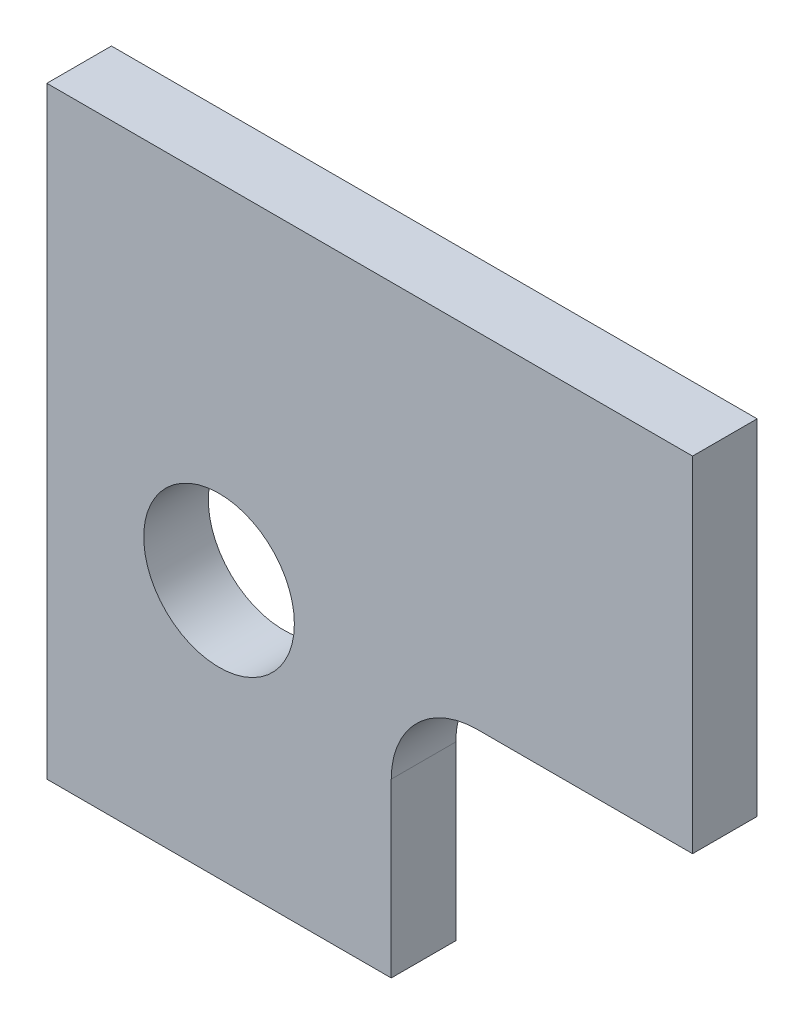
ISO-10303-21;
HEADER;
FILE_DESCRIPTION(('STEP AP214'),'2;1');
FILE_NAME('part.step','',(''),(''),'','','');
FILE_SCHEMA(('AUTOMOTIVE_DESIGN { 1 0 10303 214 1 1 1 1 }'));
ENDSEC;
DATA;
#1=APPLICATION_CONTEXT('core data for automotive mechanical design processes');
#2=APPLICATION_PROTOCOL_DEFINITION('international standard','automotive_design',2000,#1);
#3=PRODUCT_CONTEXT('',#1,'mechanical');
#4=PRODUCT('Part','Part','',(#3));
#5=PRODUCT_RELATED_PRODUCT_CATEGORY('part','',(#4));
#6=PRODUCT_DEFINITION_FORMATION('','',#4);
#7=PRODUCT_DEFINITION_CONTEXT('part definition',#1,'design');
#8=PRODUCT_DEFINITION('design','',#6,#7);
#9=PRODUCT_DEFINITION_SHAPE('','',#8);
#10=(LENGTH_UNIT() NAMED_UNIT(*) SI_UNIT(.MILLI.,.METRE.));
#11=(NAMED_UNIT(*) PLANE_ANGLE_UNIT() SI_UNIT($,.RADIAN.));
#12=(NAMED_UNIT(*) SI_UNIT($,.STERADIAN.) SOLID_ANGLE_UNIT());
#13=UNCERTAINTY_MEASURE_WITH_UNIT(LENGTH_MEASURE(1.E-05),#10,'distance_accuracy_value','');
#14=(GEOMETRIC_REPRESENTATION_CONTEXT(3) GLOBAL_UNCERTAINTY_ASSIGNED_CONTEXT((#13)) GLOBAL_UNIT_ASSIGNED_CONTEXT((#10,
#11,#12)) REPRESENTATION_CONTEXT('',''));
#15=CARTESIAN_POINT('',(0.,0.,0.));
#16=DIRECTION('',(0.,0.,1.));
#17=DIRECTION('',(1.,0.,0.));
#18=AXIS2_PLACEMENT_3D('',#15,#16,#17);
#19=CARTESIAN_POINT('',(6.,-2.00000000000001,1.5));
#20=DIRECTION('',(0.,0.,1.));
#21=DIRECTION('',(1.,0.,0.));
#22=AXIS2_PLACEMENT_3D('',#19,#20,#21);
#23=PLANE('',#22);
#24=DIRECTION('',(0.,1.,0.));
#25=VECTOR('',#24,1.);
#26=CARTESIAN_POINT('',(4.,-2.00000000000001,1.5));
#27=LINE('',#26,#25);
#28=CARTESIAN_POINT('',(4.,-6.,1.5));
#29=VERTEX_POINT('',#28);
#30=CARTESIAN_POINT('',(4.,-2.00000000000001,1.5));
#31=VERTEX_POINT('',#30);
#32=EDGE_CURVE('E137',#29,#31,#27,.T.);
#33=ORIENTED_EDGE('',*,*,#32,.T.);
#34=CARTESIAN_POINT('',(6.,-2.00000000000001,1.5));
#35=DIRECTION('',(0.,0.,-1.));
#36=DIRECTION('',(1.,0.,0.));
#37=AXIS2_PLACEMENT_3D('',#34,#35,#36);
#38=CIRCLE('',#37,2.);
#39=CARTESIAN_POINT('',(6.,0.,1.5));
#40=VERTEX_POINT('',#39);
#41=EDGE_CURVE('E90',#31,#40,#38,.T.);
#42=ORIENTED_EDGE('',*,*,#41,.T.);
#43=DIRECTION('',(1.,0.,0.));
#44=VECTOR('',#43,1.);
#45=CARTESIAN_POINT('',(11.,0.,1.5));
#46=LINE('',#45,#44);
#47=CARTESIAN_POINT('',(11.,0.,1.5));
#48=VERTEX_POINT('',#47);
#49=EDGE_CURVE('E149',#40,#48,#46,.T.);
#50=ORIENTED_EDGE('',*,*,#49,.T.);
#51=DIRECTION('',(0.,1.,0.));
#52=VECTOR('',#51,1.);
#53=CARTESIAN_POINT('',(11.,8.,1.5));
#54=LINE('',#53,#52);
#55=CARTESIAN_POINT('',(11.,8.,1.5));
#56=VERTEX_POINT('',#55);
#57=EDGE_CURVE('E106',#48,#56,#54,.T.);
#58=ORIENTED_EDGE('',*,*,#57,.T.);
#59=DIRECTION('',(-1.,0.,0.));
#60=VECTOR('',#59,1.);
#61=CARTESIAN_POINT('',(-4.,8.,1.5));
#62=LINE('',#61,#60);
#63=CARTESIAN_POINT('',(-4.,8.,1.5));
#64=VERTEX_POINT('',#63);
#65=EDGE_CURVE('E100',#56,#64,#62,.T.);
#66=ORIENTED_EDGE('',*,*,#65,.T.);
#67=DIRECTION('',(0.,-1.,0.));
#68=VECTOR('',#67,1.);
#69=CARTESIAN_POINT('',(-4.,-6.,1.5));
#70=LINE('',#69,#68);
#71=CARTESIAN_POINT('',(-4.,-6.,1.5));
#72=VERTEX_POINT('',#71);
#73=EDGE_CURVE('E104',#64,#72,#70,.T.);
#74=ORIENTED_EDGE('',*,*,#73,.T.);
#75=DIRECTION('',(1.,0.,0.));
#76=VECTOR('',#75,1.);
#77=CARTESIAN_POINT('',(4.,-6.,1.5));
#78=LINE('',#77,#76);
#79=EDGE_CURVE('E50',#72,#29,#78,.T.);
#80=ORIENTED_EDGE('',*,*,#79,.T.);
#81=EDGE_LOOP('',(#33,#42,#50,#58,#66,#74,#80));
#82=FACE_BOUND('',#81,.T.);
#83=CARTESIAN_POINT('',(0.,0.,1.5));
#84=DIRECTION('',(0.,0.,1.));
#85=DIRECTION('',(1.,0.,0.));
#86=AXIS2_PLACEMENT_3D('',#83,#84,#85);
#87=CIRCLE('',#86,1.75);
#88=CARTESIAN_POINT('',(1.75,0.,1.5));
#89=VERTEX_POINT('',#88);
#90=EDGE_CURVE('E128',#89,#89,#87,.T.);
#91=ORIENTED_EDGE('',*,*,#90,.F.);
#92=EDGE_LOOP('',(#91));
#93=FACE_BOUND('',#92,.T.);
#94=ADVANCED_FACE('F33',(#82,#93),#23,.T.);
#95=CARTESIAN_POINT('',(6.,-2.00000000000001,0.));
#96=DIRECTION('',(0.,0.,1.));
#97=DIRECTION('',(1.,0.,0.));
#98=AXIS2_PLACEMENT_3D('',#95,#96,#97);
#99=PLANE('',#98);
#100=DIRECTION('',(0.,1.,0.));
#101=VECTOR('',#100,1.);
#102=CARTESIAN_POINT('',(4.,-2.00000000000001,0.));
#103=LINE('',#102,#101);
#104=CARTESIAN_POINT('',(4.,-6.,0.));
#105=VERTEX_POINT('',#104);
#106=CARTESIAN_POINT('',(4.,-2.00000000000001,0.));
#107=VERTEX_POINT('',#106);
#108=EDGE_CURVE('E124',#105,#107,#103,.T.);
#109=ORIENTED_EDGE('',*,*,#108,.F.);
#110=DIRECTION('',(1.,0.,0.));
#111=VECTOR('',#110,1.);
#112=CARTESIAN_POINT('',(4.,-6.,0.));
#113=LINE('',#112,#111);
#114=CARTESIAN_POINT('',(-4.,-6.,0.));
#115=VERTEX_POINT('',#114);
#116=EDGE_CURVE('E82',#115,#105,#113,.T.);
#117=ORIENTED_EDGE('',*,*,#116,.F.);
#118=DIRECTION('',(0.,-1.,0.));
#119=VECTOR('',#118,1.);
#120=CARTESIAN_POINT('',(-4.,-6.,0.));
#121=LINE('',#120,#119);
#122=CARTESIAN_POINT('',(-4.,8.,0.));
#123=VERTEX_POINT('',#122);
#124=EDGE_CURVE('E76',#123,#115,#121,.T.);
#125=ORIENTED_EDGE('',*,*,#124,.F.);
#126=DIRECTION('',(-1.,0.,0.));
#127=VECTOR('',#126,1.);
#128=CARTESIAN_POINT('',(-4.,8.,0.));
#129=LINE('',#128,#127);
#130=CARTESIAN_POINT('',(11.,8.,0.));
#131=VERTEX_POINT('',#130);
#132=EDGE_CURVE('E114',#131,#123,#129,.T.);
#133=ORIENTED_EDGE('',*,*,#132,.F.);
#134=DIRECTION('',(0.,1.,0.));
#135=VECTOR('',#134,1.);
#136=CARTESIAN_POINT('',(11.,8.,0.));
#137=LINE('',#136,#135);
#138=CARTESIAN_POINT('',(11.,0.,0.));
#139=VERTEX_POINT('',#138);
#140=EDGE_CURVE('E132',#139,#131,#137,.T.);
#141=ORIENTED_EDGE('',*,*,#140,.F.);
#142=DIRECTION('',(1.,0.,0.));
#143=VECTOR('',#142,1.);
#144=CARTESIAN_POINT('',(11.,0.,0.));
#145=LINE('',#144,#143);
#146=CARTESIAN_POINT('',(6.,0.,0.));
#147=VERTEX_POINT('',#146);
#148=EDGE_CURVE('E130',#147,#139,#145,.T.);
#149=ORIENTED_EDGE('',*,*,#148,.F.);
#150=CARTESIAN_POINT('',(6.,-2.00000000000001,0.));
#151=DIRECTION('',(0.,0.,-1.));
#152=DIRECTION('',(1.,0.,0.));
#153=AXIS2_PLACEMENT_3D('',#150,#151,#152);
#154=CIRCLE('',#153,2.);
#155=EDGE_CURVE('E127',#107,#147,#154,.T.);
#156=ORIENTED_EDGE('',*,*,#155,.F.);
#157=EDGE_LOOP('',(#109,#117,#125,#133,#141,#149,#156));
#158=FACE_BOUND('',#157,.T.);
#159=CARTESIAN_POINT('',(0.,0.,0.));
#160=DIRECTION('',(0.,0.,1.));
#161=DIRECTION('',(1.,0.,0.));
#162=AXIS2_PLACEMENT_3D('',#159,#160,#161);
#163=CIRCLE('',#162,1.75);
#164=CARTESIAN_POINT('',(1.75,0.,0.));
#165=VERTEX_POINT('',#164);
#166=EDGE_CURVE('E161',#165,#165,#163,.T.);
#167=ORIENTED_EDGE('',*,*,#166,.T.);
#168=EDGE_LOOP('',(#167));
#169=FACE_BOUND('',#168,.T.);
#170=ADVANCED_FACE('F153',(#158,#169),#99,.F.);
#171=CARTESIAN_POINT('',(4.,-2.00000000000001,1.5));
#172=DIRECTION('',(-1.,0.,0.));
#173=DIRECTION('',(0.,-1.,0.));
#174=AXIS2_PLACEMENT_3D('',#171,#172,#173);
#175=PLANE('',#174);
#176=ORIENTED_EDGE('',*,*,#108,.T.);
#177=DIRECTION('',(0.,0.,-1.));
#178=VECTOR('',#177,1.);
#179=CARTESIAN_POINT('',(4.,-2.00000000000001,1.5));
#180=LINE('',#179,#178);
#181=EDGE_CURVE('E11',#31,#107,#180,.T.);
#182=ORIENTED_EDGE('',*,*,#181,.F.);
#183=ORIENTED_EDGE('',*,*,#32,.F.);
#184=DIRECTION('',(0.,0.,-1.));
#185=VECTOR('',#184,1.);
#186=CARTESIAN_POINT('',(4.,-6.,1.5));
#187=LINE('',#186,#185);
#188=EDGE_CURVE('E120',#29,#105,#187,.T.);
#189=ORIENTED_EDGE('',*,*,#188,.T.);
#190=EDGE_LOOP('',(#176,#182,#183,#189));
#191=FACE_BOUND('',#190,.T.);
#192=ADVANCED_FACE('F35',(#191),#175,.F.);
#193=CARTESIAN_POINT('',(6.,-2.00000000000001,1.5));
#194=DIRECTION('',(0.,0.,-1.));
#195=DIRECTION('',(-1.,0.,0.));
#196=AXIS2_PLACEMENT_3D('',#193,#194,#195);
#197=CYLINDRICAL_SURFACE('',#196,2.);
#198=ORIENTED_EDGE('',*,*,#155,.T.);
#199=DIRECTION('',(0.,0.,-1.));
#200=VECTOR('',#199,1.);
#201=CARTESIAN_POINT('',(6.,0.,1.5));
#202=LINE('',#201,#200);
#203=EDGE_CURVE('E42',#40,#147,#202,.T.);
#204=ORIENTED_EDGE('',*,*,#203,.F.);
#205=ORIENTED_EDGE('',*,*,#41,.F.);
#206=ORIENTED_EDGE('',*,*,#181,.T.);
#207=EDGE_LOOP('',(#198,#204,#205,#206));
#208=FACE_BOUND('',#207,.T.);
#209=ADVANCED_FACE('F187',(#208),#197,.F.);
#210=CARTESIAN_POINT('',(11.,0.,1.5));
#211=DIRECTION('',(0.,1.,0.));
#212=DIRECTION('',(-1.,0.,0.));
#213=AXIS2_PLACEMENT_3D('',#210,#211,#212);
#214=PLANE('',#213);
#215=ORIENTED_EDGE('',*,*,#148,.T.);
#216=DIRECTION('',(0.,0.,-1.));
#217=VECTOR('',#216,1.);
#218=CARTESIAN_POINT('',(11.,0.,1.5));
#219=LINE('',#218,#217);
#220=EDGE_CURVE('E141',#48,#139,#219,.T.);
#221=ORIENTED_EDGE('',*,*,#220,.F.);
#222=ORIENTED_EDGE('',*,*,#49,.F.);
#223=ORIENTED_EDGE('',*,*,#203,.T.);
#224=EDGE_LOOP('',(#215,#221,#222,#223));
#225=FACE_BOUND('',#224,.T.);
#226=ADVANCED_FACE('F147',(#225),#214,.F.);
#227=CARTESIAN_POINT('',(11.,8.,1.5));
#228=DIRECTION('',(-1.,0.,0.));
#229=DIRECTION('',(0.,0.,1.));
#230=AXIS2_PLACEMENT_3D('',#227,#228,#229);
#231=PLANE('',#230);
#232=ORIENTED_EDGE('',*,*,#140,.T.);
#233=DIRECTION('',(0.,0.,-1.));
#234=VECTOR('',#233,1.);
#235=CARTESIAN_POINT('',(11.,8.,1.5));
#236=LINE('',#235,#234);
#237=EDGE_CURVE('E115',#56,#131,#236,.T.);
#238=ORIENTED_EDGE('',*,*,#237,.F.);
#239=ORIENTED_EDGE('',*,*,#57,.F.);
#240=ORIENTED_EDGE('',*,*,#220,.T.);
#241=EDGE_LOOP('',(#232,#238,#239,#240));
#242=FACE_BOUND('',#241,.T.);
#243=ADVANCED_FACE('F156',(#242),#231,.F.);
#244=CARTESIAN_POINT('',(-4.,8.,1.5));
#245=DIRECTION('',(0.,-1.,0.));
#246=DIRECTION('',(0.,0.,-1.));
#247=AXIS2_PLACEMENT_3D('',#244,#245,#246);
#248=PLANE('',#247);
#249=ORIENTED_EDGE('',*,*,#132,.T.);
#250=DIRECTION('',(0.,0.,-1.));
#251=VECTOR('',#250,1.);
#252=CARTESIAN_POINT('',(-4.,8.,1.5));
#253=LINE('',#252,#251);
#254=EDGE_CURVE('E111',#64,#123,#253,.T.);
#255=ORIENTED_EDGE('',*,*,#254,.F.);
#256=ORIENTED_EDGE('',*,*,#65,.F.);
#257=ORIENTED_EDGE('',*,*,#237,.T.);
#258=EDGE_LOOP('',(#249,#255,#256,#257));
#259=FACE_BOUND('',#258,.T.);
#260=ADVANCED_FACE('F112',(#259),#248,.F.);
#261=CARTESIAN_POINT('',(-4.,-6.,1.5));
#262=DIRECTION('',(1.,0.,0.));
#263=DIRECTION('',(0.,0.,-1.));
#264=AXIS2_PLACEMENT_3D('',#261,#262,#263);
#265=PLANE('',#264);
#266=ORIENTED_EDGE('',*,*,#124,.T.);
#267=DIRECTION('',(0.,0.,-1.));
#268=VECTOR('',#267,1.);
#269=CARTESIAN_POINT('',(-4.,-6.,1.5));
#270=LINE('',#269,#268);
#271=EDGE_CURVE('E116',#72,#115,#270,.T.);
#272=ORIENTED_EDGE('',*,*,#271,.F.);
#273=ORIENTED_EDGE('',*,*,#73,.F.);
#274=ORIENTED_EDGE('',*,*,#254,.T.);
#275=EDGE_LOOP('',(#266,#272,#273,#274));
#276=FACE_BOUND('',#275,.T.);
#277=ADVANCED_FACE('F118',(#276),#265,.F.);
#278=CARTESIAN_POINT('',(4.,-6.,1.5));
#279=DIRECTION('',(0.,1.,0.));
#280=DIRECTION('',(-1.,0.,0.));
#281=AXIS2_PLACEMENT_3D('',#278,#279,#280);
#282=PLANE('',#281);
#283=ORIENTED_EDGE('',*,*,#116,.T.);
#284=ORIENTED_EDGE('',*,*,#188,.F.);
#285=ORIENTED_EDGE('',*,*,#79,.F.);
#286=ORIENTED_EDGE('',*,*,#271,.T.);
#287=EDGE_LOOP('',(#283,#284,#285,#286));
#288=FACE_BOUND('',#287,.T.);
#289=ADVANCED_FACE('F177',(#288),#282,.F.);
#290=CARTESIAN_POINT('',(0.,0.,1.5));
#291=DIRECTION('',(0.,0.,-1.));
#292=DIRECTION('',(-1.,0.,0.));
#293=AXIS2_PLACEMENT_3D('',#290,#291,#292);
#294=CYLINDRICAL_SURFACE('',#293,1.75);
#295=ORIENTED_EDGE('',*,*,#90,.T.);
#296=EDGE_LOOP('',(#295));
#297=FACE_BOUND('',#296,.T.);
#298=ORIENTED_EDGE('',*,*,#166,.F.);
#299=EDGE_LOOP('',(#298));
#300=FACE_BOUND('',#299,.T.);
#301=ADVANCED_FACE('F167',(#297,#300),#294,.F.);
#302=CLOSED_SHELL('',(#94,#170,#192,#209,#226,#243,#260,#277,#289,#301));
#303=MANIFOLD_SOLID_BREP('B2',#302);
#304=ADVANCED_BREP_SHAPE_REPRESENTATION('',(#18,#303),#14);
#305=SHAPE_DEFINITION_REPRESENTATION(#9,#304);
ENDSEC;
END-ISO-10303-21;
